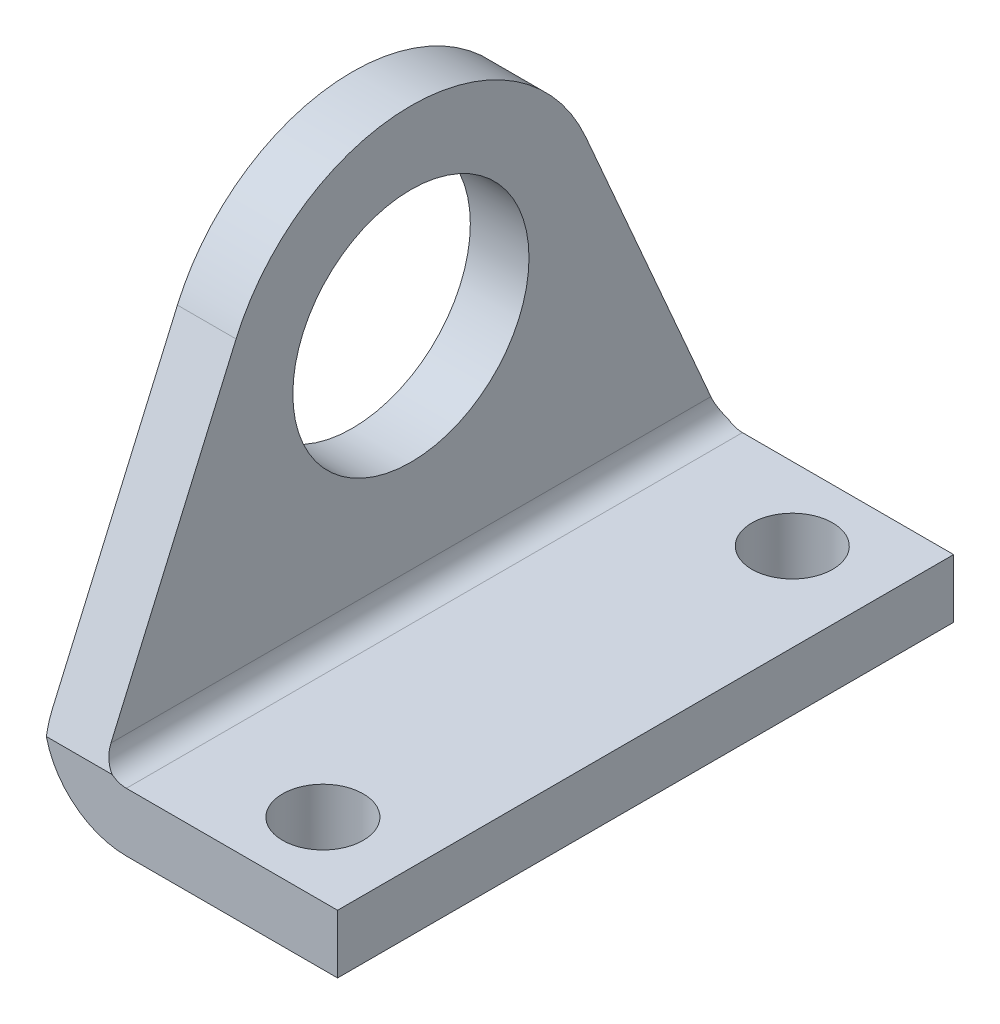
ISO-10303-21;
HEADER;
FILE_DESCRIPTION(('STEP AP214'),'2;1');
FILE_NAME('part.step','',(''),(''),'','','');
FILE_SCHEMA(('AUTOMOTIVE_DESIGN { 1 0 10303 214 1 1 1 1 }'));
ENDSEC;
DATA;
#1=APPLICATION_CONTEXT('core data for automotive mechanical design processes');
#2=APPLICATION_PROTOCOL_DEFINITION('international standard','automotive_design',2000,#1);
#3=PRODUCT_CONTEXT('',#1,'mechanical');
#4=PRODUCT('Part','Part','',(#3));
#5=PRODUCT_RELATED_PRODUCT_CATEGORY('part','',(#4));
#6=PRODUCT_DEFINITION_FORMATION('','',#4);
#7=PRODUCT_DEFINITION_CONTEXT('part definition',#1,'design');
#8=PRODUCT_DEFINITION('design','',#6,#7);
#9=PRODUCT_DEFINITION_SHAPE('','',#8);
#10=(LENGTH_UNIT() NAMED_UNIT(*) SI_UNIT(.MILLI.,.METRE.));
#11=(NAMED_UNIT(*) PLANE_ANGLE_UNIT() SI_UNIT($,.RADIAN.));
#12=(NAMED_UNIT(*) SI_UNIT($,.STERADIAN.) SOLID_ANGLE_UNIT());
#13=UNCERTAINTY_MEASURE_WITH_UNIT(LENGTH_MEASURE(1.E-05),#10,'distance_accuracy_value','');
#14=(GEOMETRIC_REPRESENTATION_CONTEXT(3) GLOBAL_UNCERTAINTY_ASSIGNED_CONTEXT((#13)) GLOBAL_UNIT_ASSIGNED_CONTEXT((#10,
#11,#12)) REPRESENTATION_CONTEXT('',''));
#15=CARTESIAN_POINT('',(0.,0.,0.));
#16=DIRECTION('',(0.,0.,1.));
#17=DIRECTION('',(1.,0.,0.));
#18=AXIS2_PLACEMENT_3D('',#15,#16,#17);
#19=CARTESIAN_POINT('',(4.,5.6,-21.));
#20=DIRECTION('',(1.,0.,0.));
#21=DIRECTION('',(0.,0.,-1.));
#22=AXIS2_PLACEMENT_3D('',#19,#20,#21);
#23=PLANE('',#22);
#24=CARTESIAN_POINT('',(4.,20.,0.));
#25=DIRECTION('',(1.,0.,0.));
#26=DIRECTION('',(0.,0.,-1.));
#27=AXIS2_PLACEMENT_3D('',#24,#25,#26);
#28=CIRCLE('',#27,8.05);
#29=CARTESIAN_POINT('',(4.,20.,-8.05));
#30=VERTEX_POINT('',#29);
#31=EDGE_CURVE('E188',#30,#30,#28,.F.);
#32=ORIENTED_EDGE('',*,*,#31,.T.);
#33=EDGE_LOOP('',(#32));
#34=FACE_BOUND('',#33,.T.);
#35=CARTESIAN_POINT('',(4.,19.9999999999996,0.));
#36=DIRECTION('',(1.,0.,0.));
#37=DIRECTION('',(0.,0.,-1.));
#38=AXIS2_PLACEMENT_3D('',#35,#36,#37);
#39=CIRCLE('',#38,13.0000000000004);
#40=CARTESIAN_POINT('',(4.,25.188847396554,-11.919557990768));
#41=VERTEX_POINT('',#40);
#42=CARTESIAN_POINT('',(4.,25.188847396554,11.919557990768));
#43=VERTEX_POINT('',#42);
#44=EDGE_CURVE('E131',#41,#43,#39,.T.);
#45=ORIENTED_EDGE('',*,*,#44,.T.);
#46=DIRECTION('',(0.,-0.916889076212924,0.39914210742718));
#47=VECTOR('',#46,1.);
#48=CARTESIAN_POINT('',(4.,20.7683248735101,13.8439092798735));
#49=LINE('',#48,#47);
#50=CARTESIAN_POINT('',(4.,5.6,20.4470168020608));
#51=VERTEX_POINT('',#50);
#52=EDGE_CURVE('E115',#43,#51,#49,.T.);
#53=ORIENTED_EDGE('',*,*,#52,.T.);
#54=DIRECTION('',(0.,0.,1.));
#55=VECTOR('',#54,1.);
#56=CARTESIAN_POINT('',(4.,5.6,-21.));
#57=LINE('',#56,#55);
#58=CARTESIAN_POINT('',(4.,5.6,-20.4470168020608));
#59=VERTEX_POINT('',#58);
#60=EDGE_CURVE('E171',#59,#51,#57,.T.);
#61=ORIENTED_EDGE('',*,*,#60,.F.);
#62=DIRECTION('',(0.,0.916889076212924,0.39914210742718));
#63=VECTOR('',#62,1.);
#64=CARTESIAN_POINT('',(4.,5.39762527093343,-20.5351150005727));
#65=LINE('',#64,#63);
#66=EDGE_CURVE('E136',#59,#41,#65,.T.);
#67=ORIENTED_EDGE('',*,*,#66,.T.);
#68=EDGE_LOOP('',(#45,#53,#61,#67));
#69=FACE_BOUND('',#68,.T.);
#70=ADVANCED_FACE('F36',(#34,#69),#23,.T.);
#71=CARTESIAN_POINT('',(5.59999999999989,5.59999999999989,-21.));
#72=DIRECTION('',(0.,0.,1.));
#73=DIRECTION('',(1.,0.,0.));
#74=AXIS2_PLACEMENT_3D('',#71,#72,#73);
#75=CYLINDRICAL_SURFACE('',#74,1.59999999999989);
#76=ORIENTED_EDGE('',*,*,#60,.T.);
#77=CARTESIAN_POINT('',(5.59999999999989,5.59999999999989,20.4470168020608));
#78=DIRECTION('',(0.,0.39914210742718,0.916889076212924));
#79=DIRECTION('',(0.,-0.916889076212924,0.39914210742718));
#80=AXIS2_PLACEMENT_3D('',#77,#78,#79);
#81=ELLIPSE('',#80,1.74503115099642,1.59999999999989);
#82=CARTESIAN_POINT('',(4.62718147562115,4.32971494591745,21.));
#83=VERTEX_POINT('',#82);
#84=EDGE_CURVE('E121',#51,#83,#81,.T.);
#85=ORIENTED_EDGE('',*,*,#84,.T.);
#86=CARTESIAN_POINT('',(5.59999999999989,5.59999999999989,21.));
#87=DIRECTION('',(0.,0.,-1.));
#88=DIRECTION('',(1.,0.,0.));
#89=AXIS2_PLACEMENT_3D('',#86,#87,#88);
#90=CIRCLE('',#89,1.59999999999989);
#91=CARTESIAN_POINT('',(5.6,4.,21.));
#92=VERTEX_POINT('',#91);
#93=EDGE_CURVE('E154',#92,#83,#90,.T.);
#94=ORIENTED_EDGE('',*,*,#93,.F.);
#95=DIRECTION('',(0.,0.,1.));
#96=VECTOR('',#95,1.);
#97=CARTESIAN_POINT('',(5.6,4.,-21.));
#98=LINE('',#97,#96);
#99=CARTESIAN_POINT('',(5.6,4.,-21.));
#100=VERTEX_POINT('',#99);
#101=EDGE_CURVE('E61',#100,#92,#98,.T.);
#102=ORIENTED_EDGE('',*,*,#101,.F.);
#103=CARTESIAN_POINT('',(5.59999999999989,5.59999999999989,-21.));
#104=DIRECTION('',(0.,0.,-1.));
#105=DIRECTION('',(1.,0.,0.));
#106=AXIS2_PLACEMENT_3D('',#103,#104,#105);
#107=CIRCLE('',#106,1.59999999999989);
#108=CARTESIAN_POINT('',(4.62718147562115,4.32971494591745,-21.));
#109=VERTEX_POINT('',#108);
#110=EDGE_CURVE('E168',#100,#109,#107,.T.);
#111=ORIENTED_EDGE('',*,*,#110,.T.);
#112=CARTESIAN_POINT('',(5.59999999999989,5.59999999999989,-20.4470168020608));
#113=DIRECTION('',(0.,0.39914210742718,-0.916889076212924));
#114=DIRECTION('',(0.,0.916889076212924,0.39914210742718));
#115=AXIS2_PLACEMENT_3D('',#112,#113,#114);
#116=ELLIPSE('',#115,1.74503115099642,1.59999999999989);
#117=EDGE_CURVE('E212',#109,#59,#116,.T.);
#118=ORIENTED_EDGE('',*,*,#117,.T.);
#119=EDGE_LOOP('',(#76,#85,#94,#102,#111,#118));
#120=FACE_BOUND('',#119,.T.);
#121=ADVANCED_FACE('F214',(#120),#75,.F.);
#122=CARTESIAN_POINT('',(5.59999999999989,5.59999999999989,-21.));
#123=DIRECTION('',(0.,0.,1.));
#124=DIRECTION('',(1.,0.,0.));
#125=AXIS2_PLACEMENT_3D('',#122,#123,#124);
#126=CYLINDRICAL_SURFACE('',#125,5.59999999999989);
#127=CARTESIAN_POINT('',(5.59999999999989,5.59999999999989,21.));
#128=DIRECTION('',(0.,0.,1.));
#129=DIRECTION('',(1.,0.,0.));
#130=AXIS2_PLACEMENT_3D('',#127,#128,#129);
#131=CIRCLE('',#130,5.59999999999989);
#132=CARTESIAN_POINT('',(0.1459761752102,4.32971494591745,21.));
#133=VERTEX_POINT('',#132);
#134=CARTESIAN_POINT('',(5.59999999999999,0.,21.));
#135=VERTEX_POINT('',#134);
#136=EDGE_CURVE('E137',#133,#135,#131,.T.);
#137=ORIENTED_EDGE('',*,*,#136,.F.);
#138=CARTESIAN_POINT('',(5.59999999999989,5.59999999999989,20.4470168020608));
#139=DIRECTION('',(0.,0.39914210742718,0.916889076212924));
#140=DIRECTION('',(0.,-0.916889076212924,0.39914210742718));
#141=AXIS2_PLACEMENT_3D('',#138,#139,#140);
#142=ELLIPSE('',#141,6.10760902848779,5.59999999999989);
#143=CARTESIAN_POINT('',(0.,5.6,20.4470168020608));
#144=VERTEX_POINT('',#143);
#145=EDGE_CURVE('E53',#133,#144,#142,.F.);
#146=ORIENTED_EDGE('',*,*,#145,.T.);
#147=DIRECTION('',(0.,0.,1.));
#148=VECTOR('',#147,1.);
#149=CARTESIAN_POINT('',(0.,5.6,-21.));
#150=LINE('',#149,#148);
#151=CARTESIAN_POINT('',(0.,5.6,-20.4470168020608));
#152=VERTEX_POINT('',#151);
#153=EDGE_CURVE('E170',#152,#144,#150,.T.);
#154=ORIENTED_EDGE('',*,*,#153,.F.);
#155=CARTESIAN_POINT('',(5.59999999999989,5.59999999999989,-20.4470168020608));
#156=DIRECTION('',(0.,0.39914210742718,-0.916889076212924));
#157=DIRECTION('',(0.,0.916889076212924,0.39914210742718));
#158=AXIS2_PLACEMENT_3D('',#155,#156,#157);
#159=ELLIPSE('',#158,6.10760902848779,5.59999999999989);
#160=CARTESIAN_POINT('',(0.145976175210201,4.32971494591745,-21.));
#161=VERTEX_POINT('',#160);
#162=EDGE_CURVE('E209',#152,#161,#159,.F.);
#163=ORIENTED_EDGE('',*,*,#162,.T.);
#164=CARTESIAN_POINT('',(5.59999999999989,5.59999999999989,-21.));
#165=DIRECTION('',(0.,0.,1.));
#166=DIRECTION('',(1.,0.,0.));
#167=AXIS2_PLACEMENT_3D('',#164,#165,#166);
#168=CIRCLE('',#167,5.59999999999989);
#169=CARTESIAN_POINT('',(5.59999999999999,0.,-21.));
#170=VERTEX_POINT('',#169);
#171=EDGE_CURVE('E157',#161,#170,#168,.T.);
#172=ORIENTED_EDGE('',*,*,#171,.T.);
#173=DIRECTION('',(0.,0.,1.));
#174=VECTOR('',#173,1.);
#175=CARTESIAN_POINT('',(5.59999999999999,0.,-21.));
#176=LINE('',#175,#174);
#177=EDGE_CURVE('E179',#170,#135,#176,.T.);
#178=ORIENTED_EDGE('',*,*,#177,.T.);
#179=EDGE_LOOP('',(#137,#146,#154,#163,#172,#178));
#180=FACE_BOUND('',#179,.T.);
#181=ADVANCED_FACE('F227',(#180),#126,.T.);
#182=CARTESIAN_POINT('',(0.,40.,-21.));
#183=DIRECTION('',(-1.,0.,0.));
#184=DIRECTION('',(0.,0.,1.));
#185=AXIS2_PLACEMENT_3D('',#182,#183,#184);
#186=PLANE('',#185);
#187=CARTESIAN_POINT('',(0.,20.,0.));
#188=DIRECTION('',(-1.,0.,0.));
#189=DIRECTION('',(0.,0.,1.));
#190=AXIS2_PLACEMENT_3D('',#187,#188,#189);
#191=CIRCLE('',#190,8.05);
#192=CARTESIAN_POINT('',(0.,20.,8.05));
#193=VERTEX_POINT('',#192);
#194=EDGE_CURVE('E186',#193,#193,#191,.F.);
#195=ORIENTED_EDGE('',*,*,#194,.T.);
#196=EDGE_LOOP('',(#195));
#197=FACE_BOUND('',#196,.T.);
#198=ORIENTED_EDGE('',*,*,#153,.T.);
#199=DIRECTION('',(0.,0.916889076212924,-0.39914210742718));
#200=VECTOR('',#199,1.);
#201=CARTESIAN_POINT('',(0.,49.6879087594136,1.25457436728687));
#202=LINE('',#201,#200);
#203=CARTESIAN_POINT('',(0.,25.188847396554,11.919557990768));
#204=VERTEX_POINT('',#203);
#205=EDGE_CURVE('E126',#144,#204,#202,.T.);
#206=ORIENTED_EDGE('',*,*,#205,.T.);
#207=CARTESIAN_POINT('',(0.,19.9999999999996,0.));
#208=DIRECTION('',(-1.,0.,0.));
#209=DIRECTION('',(0.,0.,1.));
#210=AXIS2_PLACEMENT_3D('',#207,#208,#209);
#211=CIRCLE('',#210,13.0000000000004);
#212=CARTESIAN_POINT('',(0.,25.188847396554,-11.919557990768));
#213=VERTEX_POINT('',#212);
#214=EDGE_CURVE('E11',#204,#213,#211,.T.);
#215=ORIENTED_EDGE('',*,*,#214,.T.);
#216=DIRECTION('',(0.,-0.916889076212924,-0.39914210742718));
#217=VECTOR('',#216,1.);
#218=CARTESIAN_POINT('',(0.,34.3172091568369,-7.94578008798613));
#219=LINE('',#218,#217);
#220=EDGE_CURVE('E138',#213,#152,#219,.T.);
#221=ORIENTED_EDGE('',*,*,#220,.T.);
#222=EDGE_LOOP('',(#198,#206,#215,#221));
#223=FACE_BOUND('',#222,.T.);
#224=ADVANCED_FACE('F38',(#197,#223),#186,.T.);
#225=CARTESIAN_POINT('',(5.59999999999989,5.59999999999989,-21.));
#226=DIRECTION('',(0.,0.,1.));
#227=DIRECTION('',(1.,0.,0.));
#228=AXIS2_PLACEMENT_3D('',#225,#226,#227);
#229=PLANE('',#228);
#230=DIRECTION('',(-1.,0.,0.));
#231=VECTOR('',#230,1.);
#232=CARTESIAN_POINT('',(5.59999999999989,4.32971494591745,-21.));
#233=LINE('',#232,#231);
#234=EDGE_CURVE('E45',#109,#161,#233,.T.);
#235=ORIENTED_EDGE('',*,*,#234,.F.);
#236=ORIENTED_EDGE('',*,*,#110,.F.);
#237=DIRECTION('',(-1.,0.,0.));
#238=VECTOR('',#237,1.);
#239=CARTESIAN_POINT('',(20.,4.,-21.));
#240=LINE('',#239,#238);
#241=CARTESIAN_POINT('',(20.,4.,-21.));
#242=VERTEX_POINT('',#241);
#243=EDGE_CURVE('E165',#242,#100,#240,.T.);
#244=ORIENTED_EDGE('',*,*,#243,.F.);
#245=DIRECTION('',(0.,1.,0.));
#246=VECTOR('',#245,1.);
#247=CARTESIAN_POINT('',(20.,0.,-21.));
#248=LINE('',#247,#246);
#249=CARTESIAN_POINT('',(20.,0.,-21.));
#250=VERTEX_POINT('',#249);
#251=EDGE_CURVE('E162',#250,#242,#248,.T.);
#252=ORIENTED_EDGE('',*,*,#251,.F.);
#253=DIRECTION('',(1.,0.,0.));
#254=VECTOR('',#253,1.);
#255=CARTESIAN_POINT('',(5.6,0.,-21.));
#256=LINE('',#255,#254);
#257=EDGE_CURVE('E159',#170,#250,#256,.T.);
#258=ORIENTED_EDGE('',*,*,#257,.F.);
#259=ORIENTED_EDGE('',*,*,#171,.F.);
#260=EDGE_LOOP('',(#235,#236,#244,#252,#258,#259));
#261=FACE_BOUND('',#260,.T.);
#262=ADVANCED_FACE('F220',(#261),#229,.F.);
#263=CARTESIAN_POINT('',(5.59999999999989,5.59999999999989,21.));
#264=DIRECTION('',(0.,0.,1.));
#265=DIRECTION('',(1.,0.,0.));
#266=AXIS2_PLACEMENT_3D('',#263,#264,#265);
#267=PLANE('',#266);
#268=ORIENTED_EDGE('',*,*,#93,.T.);
#269=DIRECTION('',(-1.,0.,0.));
#270=VECTOR('',#269,1.);
#271=CARTESIAN_POINT('',(5.59999999999989,4.32971494591745,21.));
#272=LINE('',#271,#270);
#273=EDGE_CURVE('E173',#83,#133,#272,.T.);
#274=ORIENTED_EDGE('',*,*,#273,.T.);
#275=ORIENTED_EDGE('',*,*,#136,.T.);
#276=DIRECTION('',(1.,0.,0.));
#277=VECTOR('',#276,1.);
#278=CARTESIAN_POINT('',(5.6,0.,21.));
#279=LINE('',#278,#277);
#280=CARTESIAN_POINT('',(20.,0.,21.));
#281=VERTEX_POINT('',#280);
#282=EDGE_CURVE('E140',#135,#281,#279,.T.);
#283=ORIENTED_EDGE('',*,*,#282,.T.);
#284=DIRECTION('',(0.,1.,0.));
#285=VECTOR('',#284,1.);
#286=CARTESIAN_POINT('',(20.,0.,21.));
#287=LINE('',#286,#285);
#288=CARTESIAN_POINT('',(20.,4.,21.));
#289=VERTEX_POINT('',#288);
#290=EDGE_CURVE('E148',#281,#289,#287,.T.);
#291=ORIENTED_EDGE('',*,*,#290,.T.);
#292=DIRECTION('',(-1.,0.,0.));
#293=VECTOR('',#292,1.);
#294=CARTESIAN_POINT('',(20.,4.,21.));
#295=LINE('',#294,#293);
#296=EDGE_CURVE('E151',#289,#92,#295,.T.);
#297=ORIENTED_EDGE('',*,*,#296,.T.);
#298=EDGE_LOOP('',(#268,#274,#275,#283,#291,#297));
#299=FACE_BOUND('',#298,.T.);
#300=ADVANCED_FACE('F234',(#299),#267,.T.);
#301=CARTESIAN_POINT('',(20.,4.,-21.));
#302=DIRECTION('',(0.,1.,0.));
#303=DIRECTION('',(0.,0.,1.));
#304=AXIS2_PLACEMENT_3D('',#301,#302,#303);
#305=PLANE('',#304);
#306=CARTESIAN_POINT('',(14.,4.,16.));
#307=DIRECTION('',(0.,1.,0.));
#308=DIRECTION('',(0.,0.,1.));
#309=AXIS2_PLACEMENT_3D('',#306,#307,#308);
#310=CIRCLE('',#309,2.75);
#311=CARTESIAN_POINT('',(14.,4.,18.75));
#312=VERTEX_POINT('',#311);
#313=EDGE_CURVE('E192',#312,#312,#310,.F.);
#314=ORIENTED_EDGE('',*,*,#313,.T.);
#315=EDGE_LOOP('',(#314));
#316=FACE_BOUND('',#315,.T.);
#317=CARTESIAN_POINT('',(14.,4.,-16.));
#318=DIRECTION('',(0.,1.,0.));
#319=DIRECTION('',(0.,0.,1.));
#320=AXIS2_PLACEMENT_3D('',#317,#318,#319);
#321=CIRCLE('',#320,2.75);
#322=CARTESIAN_POINT('',(14.,4.,-13.25));
#323=VERTEX_POINT('',#322);
#324=EDGE_CURVE('E189',#323,#323,#321,.F.);
#325=ORIENTED_EDGE('',*,*,#324,.T.);
#326=EDGE_LOOP('',(#325));
#327=FACE_BOUND('',#326,.T.);
#328=ORIENTED_EDGE('',*,*,#101,.T.);
#329=ORIENTED_EDGE('',*,*,#296,.F.);
#330=DIRECTION('',(0.,0.,1.));
#331=VECTOR('',#330,1.);
#332=CARTESIAN_POINT('',(20.,4.,-21.));
#333=LINE('',#332,#331);
#334=EDGE_CURVE('E175',#242,#289,#333,.T.);
#335=ORIENTED_EDGE('',*,*,#334,.F.);
#336=ORIENTED_EDGE('',*,*,#243,.T.);
#337=EDGE_LOOP('',(#328,#329,#335,#336));
#338=FACE_BOUND('',#337,.T.);
#339=ADVANCED_FACE('F239',(#316,#327,#338),#305,.T.);
#340=CARTESIAN_POINT('',(20.,0.,-21.));
#341=DIRECTION('',(1.,0.,0.));
#342=DIRECTION('',(0.,0.,-1.));
#343=AXIS2_PLACEMENT_3D('',#340,#341,#342);
#344=PLANE('',#343);
#345=ORIENTED_EDGE('',*,*,#334,.T.);
#346=ORIENTED_EDGE('',*,*,#290,.F.);
#347=DIRECTION('',(0.,0.,1.));
#348=VECTOR('',#347,1.);
#349=CARTESIAN_POINT('',(20.,0.,-21.));
#350=LINE('',#349,#348);
#351=EDGE_CURVE('E177',#250,#281,#350,.T.);
#352=ORIENTED_EDGE('',*,*,#351,.F.);
#353=ORIENTED_EDGE('',*,*,#251,.T.);
#354=EDGE_LOOP('',(#345,#346,#352,#353));
#355=FACE_BOUND('',#354,.T.);
#356=ADVANCED_FACE('F237',(#355),#344,.T.);
#357=CARTESIAN_POINT('',(5.6,0.,-21.));
#358=DIRECTION('',(0.,-1.,0.));
#359=DIRECTION('',(1.,0.,0.));
#360=AXIS2_PLACEMENT_3D('',#357,#358,#359);
#361=PLANE('',#360);
#362=CARTESIAN_POINT('',(14.,0.,16.));
#363=DIRECTION('',(0.,-1.,0.));
#364=DIRECTION('',(1.,0.,0.));
#365=AXIS2_PLACEMENT_3D('',#362,#363,#364);
#366=CIRCLE('',#365,2.75);
#367=CARTESIAN_POINT('',(16.75,0.,16.));
#368=VERTEX_POINT('',#367);
#369=EDGE_CURVE('E40',#368,#368,#366,.F.);
#370=ORIENTED_EDGE('',*,*,#369,.T.);
#371=EDGE_LOOP('',(#370));
#372=FACE_BOUND('',#371,.T.);
#373=CARTESIAN_POINT('',(14.,0.,-16.));
#374=DIRECTION('',(0.,-1.,0.));
#375=DIRECTION('',(1.,0.,0.));
#376=AXIS2_PLACEMENT_3D('',#373,#374,#375);
#377=CIRCLE('',#376,2.75);
#378=CARTESIAN_POINT('',(16.75,0.,-16.));
#379=VERTEX_POINT('',#378);
#380=EDGE_CURVE('E190',#379,#379,#377,.F.);
#381=ORIENTED_EDGE('',*,*,#380,.T.);
#382=EDGE_LOOP('',(#381));
#383=FACE_BOUND('',#382,.T.);
#384=ORIENTED_EDGE('',*,*,#351,.T.);
#385=ORIENTED_EDGE('',*,*,#282,.F.);
#386=ORIENTED_EDGE('',*,*,#177,.F.);
#387=ORIENTED_EDGE('',*,*,#257,.T.);
#388=EDGE_LOOP('',(#384,#385,#386,#387));
#389=FACE_BOUND('',#388,.T.);
#390=ADVANCED_FACE('F231',(#372,#383,#389),#361,.T.);
#391=CARTESIAN_POINT('',(14.,-1.,23.320142872992));
#392=DIRECTION('',(0.,0.39914210742718,0.916889076212924));
#393=DIRECTION('',(0.,-0.916889076212924,0.39914210742718));
#394=AXIS2_PLACEMENT_3D('',#391,#392,#393);
#395=PLANE('',#394);
#396=ORIENTED_EDGE('',*,*,#145,.F.);
#397=ORIENTED_EDGE('',*,*,#273,.F.);
#398=ORIENTED_EDGE('',*,*,#84,.F.);
#399=ORIENTED_EDGE('',*,*,#52,.F.);
#400=DIRECTION('',(-1.,0.,0.));
#401=VECTOR('',#400,1.);
#402=CARTESIAN_POINT('',(14.,25.188847396554,11.919557990768));
#403=LINE('',#402,#401);
#404=EDGE_CURVE('E118',#43,#204,#403,.T.);
#405=ORIENTED_EDGE('',*,*,#404,.T.);
#406=ORIENTED_EDGE('',*,*,#205,.F.);
#407=EDGE_LOOP('',(#396,#397,#398,#399,#405,#406));
#408=FACE_BOUND('',#407,.T.);
#409=ADVANCED_FACE('F117',(#408),#395,.T.);
#410=CARTESIAN_POINT('',(14.,19.9999999999996,0.));
#411=DIRECTION('',(-1.,0.,0.));
#412=DIRECTION('',(0.,0.,1.));
#413=AXIS2_PLACEMENT_3D('',#410,#411,#412);
#414=CYLINDRICAL_SURFACE('',#413,13.0000000000004);
#415=DIRECTION('',(-1.,0.,0.));
#416=VECTOR('',#415,1.);
#417=CARTESIAN_POINT('',(14.,25.188847396554,-11.919557990768));
#418=LINE('',#417,#416);
#419=EDGE_CURVE('E133',#41,#213,#418,.T.);
#420=ORIENTED_EDGE('',*,*,#419,.T.);
#421=ORIENTED_EDGE('',*,*,#214,.F.);
#422=ORIENTED_EDGE('',*,*,#404,.F.);
#423=ORIENTED_EDGE('',*,*,#44,.F.);
#424=EDGE_LOOP('',(#420,#421,#422,#423));
#425=FACE_BOUND('',#424,.T.);
#426=ADVANCED_FACE('F130',(#425),#414,.T.);
#427=CARTESIAN_POINT('',(14.,25.188847396554,-11.919557990768));
#428=DIRECTION('',(0.,0.39914210742718,-0.916889076212924));
#429=DIRECTION('',(0.,0.916889076212924,0.39914210742718));
#430=AXIS2_PLACEMENT_3D('',#427,#428,#429);
#431=PLANE('',#430);
#432=ORIENTED_EDGE('',*,*,#419,.F.);
#433=ORIENTED_EDGE('',*,*,#66,.F.);
#434=ORIENTED_EDGE('',*,*,#117,.F.);
#435=ORIENTED_EDGE('',*,*,#234,.T.);
#436=ORIENTED_EDGE('',*,*,#162,.F.);
#437=ORIENTED_EDGE('',*,*,#220,.F.);
#438=EDGE_LOOP('',(#432,#433,#434,#435,#436,#437));
#439=FACE_BOUND('',#438,.T.);
#440=ADVANCED_FACE('F217',(#439),#431,.T.);
#441=CARTESIAN_POINT('',(4.1,20.,0.));
#442=DIRECTION('',(-1.,0.,0.));
#443=DIRECTION('',(0.,0.,1.));
#444=AXIS2_PLACEMENT_3D('',#441,#442,#443);
#445=CYLINDRICAL_SURFACE('',#444,8.05);
#446=ORIENTED_EDGE('',*,*,#31,.F.);
#447=EDGE_LOOP('',(#446));
#448=FACE_BOUND('',#447,.T.);
#449=ORIENTED_EDGE('',*,*,#194,.F.);
#450=EDGE_LOOP('',(#449));
#451=FACE_BOUND('',#450,.T.);
#452=ADVANCED_FACE('F277',(#448,#451),#445,.F.);
#453=CARTESIAN_POINT('',(14.,4.1,-16.));
#454=DIRECTION('',(0.,-1.,0.));
#455=DIRECTION('',(0.,0.,-1.));
#456=AXIS2_PLACEMENT_3D('',#453,#454,#455);
#457=CYLINDRICAL_SURFACE('',#456,2.75);
#458=ORIENTED_EDGE('',*,*,#324,.F.);
#459=EDGE_LOOP('',(#458));
#460=FACE_BOUND('',#459,.T.);
#461=ORIENTED_EDGE('',*,*,#380,.F.);
#462=EDGE_LOOP('',(#461));
#463=FACE_BOUND('',#462,.T.);
#464=ADVANCED_FACE('F271',(#460,#463),#457,.F.);
#465=CARTESIAN_POINT('',(14.,4.1,16.));
#466=DIRECTION('',(0.,-1.,0.));
#467=DIRECTION('',(0.,0.,-1.));
#468=AXIS2_PLACEMENT_3D('',#465,#466,#467);
#469=CYLINDRICAL_SURFACE('',#468,2.75);
#470=ORIENTED_EDGE('',*,*,#313,.F.);
#471=EDGE_LOOP('',(#470));
#472=FACE_BOUND('',#471,.T.);
#473=ORIENTED_EDGE('',*,*,#369,.F.);
#474=EDGE_LOOP('',(#473));
#475=FACE_BOUND('',#474,.T.);
#476=ADVANCED_FACE('F269',(#472,#475),#469,.F.);
#477=CLOSED_SHELL('',(#70,#121,#181,#224,#262,#300,#339,#356,#390,#409,#426,#440,#452,#464,#476));
#478=MANIFOLD_SOLID_BREP('B2',#477);
#479=ADVANCED_BREP_SHAPE_REPRESENTATION('',(#18,#478),#14);
#480=SHAPE_DEFINITION_REPRESENTATION(#9,#479);
ENDSEC;
END-ISO-10303-21;
